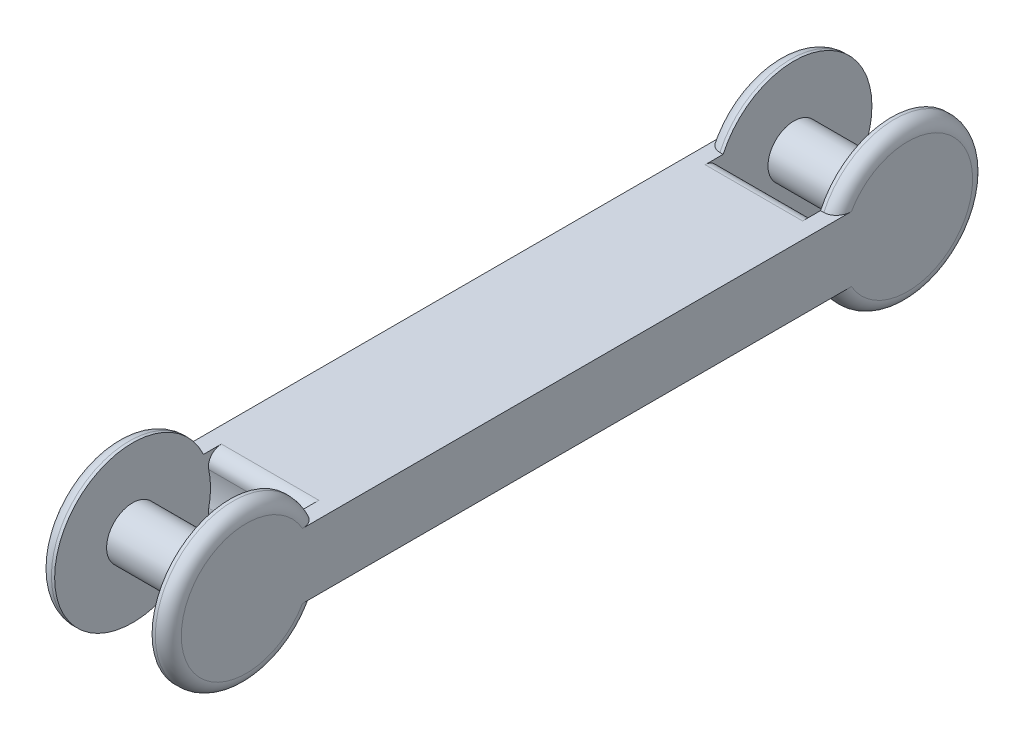
ISO-10303-21;
HEADER;
FILE_DESCRIPTION(('STEP AP214'),'2;1');
FILE_NAME('part.step','',(''),(''),'','','');
FILE_SCHEMA(('AUTOMOTIVE_DESIGN { 1 0 10303 214 1 1 1 1 }'));
ENDSEC;
DATA;
#1=APPLICATION_CONTEXT('core data for automotive mechanical design processes');
#2=APPLICATION_PROTOCOL_DEFINITION('international standard','automotive_design',2000,#1);
#3=PRODUCT_CONTEXT('',#1,'mechanical');
#4=PRODUCT('Part','Part','',(#3));
#5=PRODUCT_RELATED_PRODUCT_CATEGORY('part','',(#4));
#6=PRODUCT_DEFINITION_FORMATION('','',#4);
#7=PRODUCT_DEFINITION_CONTEXT('part definition',#1,'design');
#8=PRODUCT_DEFINITION('design','',#6,#7);
#9=PRODUCT_DEFINITION_SHAPE('','',#8);
#10=(LENGTH_UNIT() NAMED_UNIT(*) SI_UNIT(.MILLI.,.METRE.));
#11=(NAMED_UNIT(*) PLANE_ANGLE_UNIT() SI_UNIT($,.RADIAN.));
#12=(NAMED_UNIT(*) SI_UNIT($,.STERADIAN.) SOLID_ANGLE_UNIT());
#13=UNCERTAINTY_MEASURE_WITH_UNIT(LENGTH_MEASURE(1.E-05),#10,'distance_accuracy_value','');
#14=(GEOMETRIC_REPRESENTATION_CONTEXT(3) GLOBAL_UNCERTAINTY_ASSIGNED_CONTEXT((#13)) GLOBAL_UNIT_ASSIGNED_CONTEXT((#10,
#11,#12)) REPRESENTATION_CONTEXT('',''));
#15=CARTESIAN_POINT('',(0.,0.,0.));
#16=DIRECTION('',(0.,0.,1.));
#17=DIRECTION('',(1.,0.,0.));
#18=AXIS2_PLACEMENT_3D('',#15,#16,#17);
#19=CARTESIAN_POINT('',(20.,-5.00000000000001,-50.9087121146357));
#20=DIRECTION('',(-1.,0.,0.));
#21=DIRECTION('',(0.,0.,1.));
#22=AXIS2_PLACEMENT_3D('',#19,#20,#21);
#23=CYLINDRICAL_SURFACE('',#22,12.);
#24=DIRECTION('',(-1.,0.,0.));
#25=VECTOR('',#24,1.);
#26=CARTESIAN_POINT('',(20.,-10.,-40.));
#27=LINE('',#26,#25);
#28=CARTESIAN_POINT('',(2.5,-10.,-40.));
#29=VERTEX_POINT('',#28);
#30=CARTESIAN_POINT('',(2.,-10.,-40.));
#31=VERTEX_POINT('',#30);
#32=EDGE_CURVE('E191',#29,#31,#27,.T.);
#33=ORIENTED_EDGE('',*,*,#32,.T.);
#34=CARTESIAN_POINT('',(2.,-5.00000000000001,-50.9087121146357));
#35=DIRECTION('',(1.,0.,0.));
#36=DIRECTION('',(0.,0.,-1.));
#37=AXIS2_PLACEMENT_3D('',#34,#35,#36);
#38=CIRCLE('',#37,12.);
#39=CARTESIAN_POINT('',(2.,0.,-40.));
#40=VERTEX_POINT('',#39);
#41=EDGE_CURVE('E328',#31,#40,#38,.T.);
#42=ORIENTED_EDGE('',*,*,#41,.T.);
#43=DIRECTION('',(-1.,0.,0.));
#44=VECTOR('',#43,1.);
#45=CARTESIAN_POINT('',(20.,0.,-40.));
#46=LINE('',#45,#44);
#47=CARTESIAN_POINT('',(2.5,0.,-40.));
#48=VERTEX_POINT('',#47);
#49=EDGE_CURVE('E206',#48,#40,#46,.T.);
#50=ORIENTED_EDGE('',*,*,#49,.F.);
#51=CARTESIAN_POINT('',(2.5,-5.00000000000001,-50.9087121146357));
#52=DIRECTION('',(-1.,0.,0.));
#53=DIRECTION('',(0.,0.,1.));
#54=AXIS2_PLACEMENT_3D('',#51,#52,#53);
#55=CIRCLE('',#54,12.);
#56=EDGE_CURVE('E199',#48,#29,#55,.T.);
#57=ORIENTED_EDGE('',*,*,#56,.T.);
#58=EDGE_LOOP('',(#33,#42,#50,#57));
#59=FACE_BOUND('',#58,.T.);
#60=ADVANCED_FACE('F34',(#59),#23,.T.);
#61=CARTESIAN_POINT('',(20.,-5.00000000000001,50.9087121146357));
#62=DIRECTION('',(-1.,0.,0.));
#63=DIRECTION('',(0.,0.,1.));
#64=AXIS2_PLACEMENT_3D('',#61,#62,#63);
#65=CYLINDRICAL_SURFACE('',#64,12.);
#66=DIRECTION('',(-1.,0.,0.));
#67=VECTOR('',#66,1.);
#68=CARTESIAN_POINT('',(20.,0.,40.));
#69=LINE('',#68,#67);
#70=CARTESIAN_POINT('',(2.5,0.,40.));
#71=VERTEX_POINT('',#70);
#72=CARTESIAN_POINT('',(2.,0.,40.));
#73=VERTEX_POINT('',#72);
#74=EDGE_CURVE('E233',#71,#73,#69,.T.);
#75=ORIENTED_EDGE('',*,*,#74,.T.);
#76=CARTESIAN_POINT('',(2.,-5.00000000000001,50.9087121146357));
#77=DIRECTION('',(1.,0.,0.));
#78=DIRECTION('',(0.,0.,-1.));
#79=AXIS2_PLACEMENT_3D('',#76,#77,#78);
#80=CIRCLE('',#79,12.);
#81=CARTESIAN_POINT('',(2.,-10.,40.));
#82=VERTEX_POINT('',#81);
#83=EDGE_CURVE('E237',#73,#82,#80,.T.);
#84=ORIENTED_EDGE('',*,*,#83,.T.);
#85=DIRECTION('',(-1.,0.,0.));
#86=VECTOR('',#85,1.);
#87=CARTESIAN_POINT('',(20.,-10.,40.));
#88=LINE('',#87,#86);
#89=CARTESIAN_POINT('',(2.5,-10.,40.));
#90=VERTEX_POINT('',#89);
#91=EDGE_CURVE('E227',#90,#82,#88,.T.);
#92=ORIENTED_EDGE('',*,*,#91,.F.);
#93=CARTESIAN_POINT('',(2.5,-5.00000000000001,50.9087121146357));
#94=DIRECTION('',(1.,0.,0.));
#95=DIRECTION('',(0.,0.,-1.));
#96=AXIS2_PLACEMENT_3D('',#93,#94,#95);
#97=CIRCLE('',#96,12.);
#98=EDGE_CURVE('E214',#71,#90,#97,.T.);
#99=ORIENTED_EDGE('',*,*,#98,.F.);
#100=EDGE_LOOP('',(#75,#84,#92,#99));
#101=FACE_BOUND('',#100,.T.);
#102=ADVANCED_FACE('F443',(#101),#65,.T.);
#103=CARTESIAN_POINT('',(20.,0.,0.));
#104=DIRECTION('',(0.,-1.,0.));
#105=DIRECTION('',(0.,0.,-1.));
#106=AXIS2_PLACEMENT_3D('',#103,#104,#105);
#107=PLANE('',#106);
#108=DIRECTION('',(-1.,0.,0.));
#109=VECTOR('',#108,1.);
#110=CARTESIAN_POINT('',(2.5,0.,-37.2339177834584));
#111=LINE('',#110,#109);
#112=CARTESIAN_POINT('',(17.5,0.,-37.2339177834584));
#113=VERTEX_POINT('',#112);
#114=CARTESIAN_POINT('',(2.5,0.,-37.2339177834584));
#115=VERTEX_POINT('',#114);
#116=EDGE_CURVE('E341',#113,#115,#111,.T.);
#117=ORIENTED_EDGE('',*,*,#116,.T.);
#118=DIRECTION('',(0.,0.,-1.));
#119=VECTOR('',#118,1.);
#120=CARTESIAN_POINT('',(2.5,0.,-50.9087121146357));
#121=LINE('',#120,#119);
#122=EDGE_CURVE('E344',#115,#48,#121,.T.);
#123=ORIENTED_EDGE('',*,*,#122,.T.);
#124=ORIENTED_EDGE('',*,*,#49,.T.);
#125=CARTESIAN_POINT('',(2.,0.,-40.));
#126=CARTESIAN_POINT('',(1.94761864865197,0.,-39.9999920607636));
#127=CARTESIAN_POINT('',(1.89524113439899,0.,-40.002263560276));
#128=CARTESIAN_POINT('',(1.79088620311427,0.,-40.0113045157115));
#129=CARTESIAN_POINT('',(1.73890870617236,0.,-40.0180730483718));
#130=CARTESIAN_POINT('',(1.63587535487992,0.,-40.0360209027283));
#131=CARTESIAN_POINT('',(1.5848172490624,0.,-40.047187262346));
#132=CARTESIAN_POINT('',(1.48384399105233,0.,-40.0738036078068));
#133=CARTESIAN_POINT('',(1.43392885873615,0.,-40.0892536680826));
#134=CARTESIAN_POINT('',(1.28644831660157,0.,-40.1418075385946));
#135=CARTESIAN_POINT('',(1.19102421349795,0.,-40.1851368942232));
#136=CARTESIAN_POINT('',(1.00852531254498,0.,-40.2867054531951));
#137=CARTESIAN_POINT('',(0.921454306536901,0.,-40.344951384222));
#138=CARTESIAN_POINT('',(0.75486308279111,0.,-40.4764207790665));
#139=CARTESIAN_POINT('',(0.675676091014272,0.,-40.5500659671956));
#140=CARTESIAN_POINT('',(0.52963453175896,0.,-40.7086521318175));
#141=CARTESIAN_POINT('',(0.462781215257144,0.,-40.7935942526304));
#142=CARTESIAN_POINT('',(0.337143062306122,0.,-40.9799740296775));
#143=CARTESIAN_POINT('',(0.27953038496625,0.,-41.082200448377));
#144=CARTESIAN_POINT('',(0.180335553841793,0.,-41.2942407556589));
#145=CARTESIAN_POINT('',(0.138772501190277,0.,-41.404063502776));
#146=CARTESIAN_POINT('',(0.0698809101218753,0.,-41.6349866048228));
#147=CARTESIAN_POINT('',(0.0435149501782898,0.,-41.7563718328889));
#148=CARTESIAN_POINT('',(0.00857812893248845,0.,-42.0013701799645));
#149=CARTESIAN_POINT('',(-3.90550423730111E-05,0.,-42.1249766480399));
#150=CARTESIAN_POINT('',(0.,0.,-42.2484580767913));
#151=B_SPLINE_CURVE_WITH_KNOTS('',3,(#125,#126,#127,#128,#129,#130,#131,#132,#133,#134,#135,
#136,#137,#138,#139,#140,#141,#142,#143,#144,#145,#146,#147,#148,#149,#150),.UNSPECIFIED.,.F.,
.F.,(4,2,2,2,2,2,2,2,2,2,2,2,4),(0.,0.157088262959667,0.314144284895595,0.470740825804249,
0.627340087871191,0.9401669836615,1.25313522009008,1.5761765587758,1.89925064481843,
2.24984124067116,2.6008478081623,2.97216040008188,3.34250266596835),.UNSPECIFIED.);
#152=CARTESIAN_POINT('',(0.,0.,-42.2484580767913));
#153=VERTEX_POINT('',#152);
#154=EDGE_CURVE('E353',#40,#153,#151,.T.);
#155=ORIENTED_EDGE('',*,*,#154,.T.);
#156=DIRECTION('',(0.,0.,1.));
#157=VECTOR('',#156,1.);
#158=CARTESIAN_POINT('',(0.,0.,0.));
#159=LINE('',#158,#157);
#160=CARTESIAN_POINT('',(0.,0.,42.2484580767913));
#161=VERTEX_POINT('',#160);
#162=EDGE_CURVE('E217',#153,#161,#159,.T.);
#163=ORIENTED_EDGE('',*,*,#162,.T.);
#164=CARTESIAN_POINT('',(0.,0.,42.2484580767913));
#165=CARTESIAN_POINT('',(4.8833210205639E-06,0.,42.1780449974531));
#166=CARTESIAN_POINT('',(0.00279075934594604,0.,42.107657599263));
#167=CARTESIAN_POINT('',(0.0140363254196324,0.,41.9673048664754));
#168=CARTESIAN_POINT('',(0.0224987825539634,0.,41.8973397545144));
#169=CARTESIAN_POINT('',(0.0566586694762077,0.,41.6881638020816));
#170=CARTESIAN_POINT('',(0.0911305976199109,0.,41.5502606044559));
#171=CARTESIAN_POINT('',(0.183906293736824,0.,41.2821861846151));
#172=CARTESIAN_POINT('',(0.242288091272972,0.,41.1520418917903));
#173=CARTESIAN_POINT('',(0.382392919044137,0.,40.9051955188518));
#174=CARTESIAN_POINT('',(0.464062182699028,0.,40.7884633336651));
#175=CARTESIAN_POINT('',(0.639724376170037,0.,40.5845853112575));
#176=CARTESIAN_POINT('',(0.731625212290166,0.,40.4956390915064));
#177=CARTESIAN_POINT('',(0.930766416202459,0.,40.3367937467113));
#178=CARTESIAN_POINT('',(1.03800534271632,0.,40.2668928338227));
#179=CARTESIAN_POINT('',(1.25145083020004,0.,40.1564326431026));
#180=CARTESIAN_POINT('',(1.35641215028951,0.,40.1134546791329));
#181=CARTESIAN_POINT('',(1.57230306403472,0.,40.0473924478884));
#182=CARTESIAN_POINT('',(1.68321854919432,0.,40.0242631832956));
#183=CARTESIAN_POINT('',(1.82916894284576,0.,40.0077146311767));
#184=CARTESIAN_POINT('',(1.86329784951192,0.,40.004821058003));
#185=CARTESIAN_POINT('',(1.93161241425359,0.,40.0009665770984));
#186=CARTESIAN_POINT('',(1.96579790614384,0.,40.0000027255737));
#187=CARTESIAN_POINT('',(1.99999999999999,0.,40.));
#188=B_SPLINE_CURVE_WITH_KNOTS('',3,(#164,#165,#166,#167,#168,#169,#170,#171,#172,#173,#174,
#175,#176,#177,#178,#179,#180,#181,#182,#183,#184,#185,#186,#187),.UNSPECIFIED.,.F.,.F.,(4,2,2,
2,2,2,2,2,2,2,2,4),(0.,0.21112738577294,0.422357761792289,0.84656219445089,1.27216218668594,
1.69678739274252,2.07831513246147,2.45980704458993,2.79831280234283,3.13604911945941,
3.23876550054803,3.34132506785181),.UNSPECIFIED.);
#189=EDGE_CURVE('E277',#161,#73,#188,.T.);
#190=ORIENTED_EDGE('',*,*,#189,.T.);
#191=ORIENTED_EDGE('',*,*,#74,.F.);
#192=DIRECTION('',(0.,0.,-1.));
#193=VECTOR('',#192,1.);
#194=CARTESIAN_POINT('',(2.5,0.,50.9087121146357));
#195=LINE('',#194,#193);
#196=CARTESIAN_POINT('',(2.5,0.,37.2339177834584));
#197=VERTEX_POINT('',#196);
#198=EDGE_CURVE('E260',#71,#197,#195,.T.);
#199=ORIENTED_EDGE('',*,*,#198,.T.);
#200=DIRECTION('',(1.,0.,0.));
#201=VECTOR('',#200,1.);
#202=CARTESIAN_POINT('',(20.,0.,37.2339177834584));
#203=LINE('',#202,#201);
#204=CARTESIAN_POINT('',(17.5,0.,37.2339177834584));
#205=VERTEX_POINT('',#204);
#206=EDGE_CURVE('E263',#197,#205,#203,.T.);
#207=ORIENTED_EDGE('',*,*,#206,.T.);
#208=DIRECTION('',(0.,0.,1.));
#209=VECTOR('',#208,1.);
#210=CARTESIAN_POINT('',(17.5,0.,0.));
#211=LINE('',#210,#209);
#212=CARTESIAN_POINT('',(17.5,0.,40.));
#213=VERTEX_POINT('',#212);
#214=EDGE_CURVE('E266',#205,#213,#211,.T.);
#215=ORIENTED_EDGE('',*,*,#214,.T.);
#216=CARTESIAN_POINT('',(18.,0.,40.));
#217=VERTEX_POINT('',#216);
#218=EDGE_CURVE('E234',#217,#213,#69,.T.);
#219=ORIENTED_EDGE('',*,*,#218,.F.);
#220=CARTESIAN_POINT('',(18.,0.,40.));
#221=CARTESIAN_POINT('',(18.052381351348,0.,39.9999920607636));
#222=CARTESIAN_POINT('',(18.104758865601,0.,40.002263560276));
#223=CARTESIAN_POINT('',(18.2091137968857,0.,40.0113045157115));
#224=CARTESIAN_POINT('',(18.2610912938276,0.,40.0180730483718));
#225=CARTESIAN_POINT('',(18.3641246451201,0.,40.0360209027283));
#226=CARTESIAN_POINT('',(18.4151827509376,0.,40.047187262346));
#227=CARTESIAN_POINT('',(18.5161560089477,0.,40.0738036078068));
#228=CARTESIAN_POINT('',(18.5660711412638,0.,40.0892536680826));
#229=CARTESIAN_POINT('',(18.7135516833984,0.,40.1418075385946));
#230=CARTESIAN_POINT('',(18.808975786502,0.,40.1851368942232));
#231=CARTESIAN_POINT('',(18.991474687455,0.,40.2867054531951));
#232=CARTESIAN_POINT('',(19.0785456934631,0.,40.344951384222));
#233=CARTESIAN_POINT('',(19.2451369172089,0.,40.4764207790665));
#234=CARTESIAN_POINT('',(19.3243239089857,0.,40.5500659671956));
#235=CARTESIAN_POINT('',(19.470365468241,0.,40.7086521318175));
#236=CARTESIAN_POINT('',(19.5372187847429,0.,40.7935942526304));
#237=CARTESIAN_POINT('',(19.6628569376939,0.,40.9799740296775));
#238=CARTESIAN_POINT('',(19.7204696150338,0.,41.082200448377));
#239=CARTESIAN_POINT('',(19.8196644461582,0.,41.2942407556589));
#240=CARTESIAN_POINT('',(19.8612274988097,0.,41.404063502776));
#241=CARTESIAN_POINT('',(19.9301190898781,0.,41.6349866048227));
#242=CARTESIAN_POINT('',(19.9564850498217,0.,41.7563718328889));
#243=CARTESIAN_POINT('',(19.9914218710675,0.,42.0013701799645));
#244=CARTESIAN_POINT('',(20.0000390550424,0.,42.1249766480399));
#245=CARTESIAN_POINT('',(20.,0.,42.2484580767913));
#246=B_SPLINE_CURVE_WITH_KNOTS('',3,(#220,#221,#222,#223,#224,#225,#226,#227,#228,#229,#230,
#231,#232,#233,#234,#235,#236,#237,#238,#239,#240,#241,#242,#243,#244,#245),.UNSPECIFIED.,.F.,
.F.,(4,2,2,2,2,2,2,2,2,2,2,2,4),(0.,0.157088262959668,0.314144284895599,0.47074082580425,
0.627340087871192,0.940166983661496,1.25313522009008,1.5761765587758,1.89925064481843,
2.24984124067117,2.6008478081623,2.97216040008188,3.34250266596835),.UNSPECIFIED.);
#247=CARTESIAN_POINT('',(20.,0.,42.2484580767913));
#248=VERTEX_POINT('',#247);
#249=EDGE_CURVE('E310',#217,#248,#246,.T.);
#250=ORIENTED_EDGE('',*,*,#249,.T.);
#251=DIRECTION('',(0.,0.,1.));
#252=VECTOR('',#251,1.);
#253=CARTESIAN_POINT('',(20.,0.,0.));
#254=LINE('',#253,#252);
#255=CARTESIAN_POINT('',(20.,0.,-42.2484580767913));
#256=VERTEX_POINT('',#255);
#257=EDGE_CURVE('E222',#256,#248,#254,.T.);
#258=ORIENTED_EDGE('',*,*,#257,.F.);
#259=CARTESIAN_POINT('',(20.,0.,-42.2484580767913));
#260=CARTESIAN_POINT('',(19.999995116679,0.,-42.1780449974531));
#261=CARTESIAN_POINT('',(19.9972092406541,0.,-42.107657599263));
#262=CARTESIAN_POINT('',(19.9859636745804,0.,-41.9673048664754));
#263=CARTESIAN_POINT('',(19.977501217446,0.,-41.8973397545144));
#264=CARTESIAN_POINT('',(19.9433413305238,0.,-41.6881638020816));
#265=CARTESIAN_POINT('',(19.9088694023801,0.,-41.5502606044559));
#266=CARTESIAN_POINT('',(19.8160937062632,0.,-41.2821861846151));
#267=CARTESIAN_POINT('',(19.757711908727,0.,-41.1520418917903));
#268=CARTESIAN_POINT('',(19.6176070809559,0.,-40.9051955188518));
#269=CARTESIAN_POINT('',(19.535937817301,0.,-40.7884633336651));
#270=CARTESIAN_POINT('',(19.36027562383,0.,-40.5845853112575));
#271=CARTESIAN_POINT('',(19.2683747877098,0.,-40.4956390915064));
#272=CARTESIAN_POINT('',(19.0692335837975,0.,-40.3367937467113));
#273=CARTESIAN_POINT('',(18.9619946572837,0.,-40.2668928338227));
#274=CARTESIAN_POINT('',(18.7485491698,0.,-40.1564326431026));
#275=CARTESIAN_POINT('',(18.6435878497105,0.,-40.1134546791329));
#276=CARTESIAN_POINT('',(18.4276969359653,0.,-40.0473924478884));
#277=CARTESIAN_POINT('',(18.3167814508057,0.,-40.0242631832956));
#278=CARTESIAN_POINT('',(18.1708310571542,0.,-40.0077146311767));
#279=CARTESIAN_POINT('',(18.1367021504881,0.,-40.004821058003));
#280=CARTESIAN_POINT('',(18.0683875857464,0.,-40.0009665770984));
#281=CARTESIAN_POINT('',(18.0342020938562,0.,-40.0000027255737));
#282=CARTESIAN_POINT('',(18.,0.,-40.));
#283=B_SPLINE_CURVE_WITH_KNOTS('',3,(#259,#260,#261,#262,#263,#264,#265,#266,#267,#268,#269,
#270,#271,#272,#273,#274,#275,#276,#277,#278,#279,#280,#281,#282),.UNSPECIFIED.,.F.,.F.,(4,2,2,
2,2,2,2,2,2,2,2,4),(0.,0.211127385772933,0.422357761792289,0.84656219445089,1.27216218668593,
1.69678739274252,2.07831513246148,2.45980704458993,2.79831280234283,3.13604911945941,
3.23876550054804,3.34132506785182),.UNSPECIFIED.);
#284=CARTESIAN_POINT('',(18.,0.,-40.));
#285=VERTEX_POINT('',#284);
#286=EDGE_CURVE('E379',#256,#285,#283,.T.);
#287=ORIENTED_EDGE('',*,*,#286,.T.);
#288=CARTESIAN_POINT('',(17.5,0.,-40.));
#289=VERTEX_POINT('',#288);
#290=EDGE_CURVE('E205',#285,#289,#46,.T.);
#291=ORIENTED_EDGE('',*,*,#290,.T.);
#292=DIRECTION('',(0.,0.,1.));
#293=VECTOR('',#292,1.);
#294=CARTESIAN_POINT('',(17.5,0.,0.));
#295=LINE('',#294,#293);
#296=EDGE_CURVE('E48',#289,#113,#295,.T.);
#297=ORIENTED_EDGE('',*,*,#296,.T.);
#298=EDGE_LOOP('',(#117,#123,#124,#155,#163,#190,#191,#199,#207,#215,#219,#250,#258,#287,#291,#297));
#299=FACE_BOUND('',#298,.T.);
#300=ADVANCED_FACE('F294',(#299),#107,.F.);
#301=CARTESIAN_POINT('',(18.,-10.,40.));
#302=VERTEX_POINT('',#301);
#303=CARTESIAN_POINT('',(17.5,-10.,40.));
#304=VERTEX_POINT('',#303);
#305=EDGE_CURVE('E230',#302,#304,#88,.T.);
#306=ORIENTED_EDGE('',*,*,#305,.F.);
#307=CARTESIAN_POINT('',(18.,-5.00000000000001,50.9087121146357));
#308=DIRECTION('',(1.,0.,0.));
#309=DIRECTION('',(0.,0.,-1.));
#310=AXIS2_PLACEMENT_3D('',#307,#308,#309);
#311=CIRCLE('',#310,12.);
#312=EDGE_CURVE('E246',#302,#217,#311,.F.);
#313=ORIENTED_EDGE('',*,*,#312,.T.);
#314=ORIENTED_EDGE('',*,*,#218,.T.);
#315=CARTESIAN_POINT('',(17.5,-5.00000000000001,50.9087121146357));
#316=DIRECTION('',(1.,0.,0.));
#317=DIRECTION('',(0.,0.,-1.));
#318=AXIS2_PLACEMENT_3D('',#315,#316,#317);
#319=CIRCLE('',#318,12.);
#320=EDGE_CURVE('E219',#213,#304,#319,.T.);
#321=ORIENTED_EDGE('',*,*,#320,.T.);
#322=EDGE_LOOP('',(#306,#313,#314,#321));
#323=FACE_BOUND('',#322,.T.);
#324=ADVANCED_FACE('F422',(#323),#65,.T.);
#325=CARTESIAN_POINT('',(20.,-10.,40.));
#326=DIRECTION('',(0.,1.,0.));
#327=DIRECTION('',(0.,0.,1.));
#328=AXIS2_PLACEMENT_3D('',#325,#326,#327);
#329=PLANE('',#328);
#330=ORIENTED_EDGE('',*,*,#32,.F.);
#331=DIRECTION('',(0.,0.,1.));
#332=VECTOR('',#331,1.);
#333=CARTESIAN_POINT('',(2.5,-10.,-50.9087121146357));
#334=LINE('',#333,#332);
#335=CARTESIAN_POINT('',(2.5,-10.,-37.2339177834584));
#336=VERTEX_POINT('',#335);
#337=EDGE_CURVE('E56',#29,#336,#334,.T.);
#338=ORIENTED_EDGE('',*,*,#337,.T.);
#339=DIRECTION('',(-1.,0.,0.));
#340=VECTOR('',#339,1.);
#341=CARTESIAN_POINT('',(17.5,-10.,-37.2339177834584));
#342=LINE('',#341,#340);
#343=CARTESIAN_POINT('',(17.5,-10.,-37.2339177834584));
#344=VERTEX_POINT('',#343);
#345=EDGE_CURVE('E178',#336,#344,#342,.F.);
#346=ORIENTED_EDGE('',*,*,#345,.T.);
#347=DIRECTION('',(0.,0.,-1.));
#348=VECTOR('',#347,1.);
#349=CARTESIAN_POINT('',(17.5,-10.,40.));
#350=LINE('',#349,#348);
#351=CARTESIAN_POINT('',(17.5,-10.,-40.));
#352=VERTEX_POINT('',#351);
#353=EDGE_CURVE('E172',#344,#352,#350,.T.);
#354=ORIENTED_EDGE('',*,*,#353,.T.);
#355=CARTESIAN_POINT('',(18.,-10.,-40.));
#356=VERTEX_POINT('',#355);
#357=EDGE_CURVE('E176',#356,#352,#27,.T.);
#358=ORIENTED_EDGE('',*,*,#357,.F.);
#359=CARTESIAN_POINT('',(18.,-10.,-40.));
#360=CARTESIAN_POINT('',(18.052381351348,-10.,-39.9999920607636));
#361=CARTESIAN_POINT('',(18.104758865601,-10.,-40.002263560276));
#362=CARTESIAN_POINT('',(18.2091137968857,-10.,-40.0113045157115));
#363=CARTESIAN_POINT('',(18.2610912938276,-10.,-40.0180730483718));
#364=CARTESIAN_POINT('',(18.3641246451201,-10.,-40.0360209027283));
#365=CARTESIAN_POINT('',(18.4151827509376,-10.,-40.047187262346));
#366=CARTESIAN_POINT('',(18.5161560089477,-10.,-40.0738036078068));
#367=CARTESIAN_POINT('',(18.5660711412638,-10.,-40.0892536680826));
#368=CARTESIAN_POINT('',(18.7135516833984,-10.,-40.1418075385946));
#369=CARTESIAN_POINT('',(18.808975786502,-10.,-40.1851368942232));
#370=CARTESIAN_POINT('',(18.991474687455,-10.,-40.2867054531951));
#371=CARTESIAN_POINT('',(19.0785456934631,-10.,-40.344951384222));
#372=CARTESIAN_POINT('',(19.2451369172089,-10.,-40.4764207790665));
#373=CARTESIAN_POINT('',(19.3243239089857,-10.,-40.5500659671956));
#374=CARTESIAN_POINT('',(19.470365468241,-10.,-40.7086521318175));
#375=CARTESIAN_POINT('',(19.5372187847429,-10.,-40.7935942526304));
#376=CARTESIAN_POINT('',(19.6628569376939,-10.,-40.9799740296775));
#377=CARTESIAN_POINT('',(19.7204696150337,-10.,-41.0822004483769));
#378=CARTESIAN_POINT('',(19.8196644461582,-10.,-41.2942407556589));
#379=CARTESIAN_POINT('',(19.8612274988097,-10.,-41.404063502776));
#380=CARTESIAN_POINT('',(19.9301190898781,-10.,-41.6349866048227));
#381=CARTESIAN_POINT('',(19.9564850498217,-10.,-41.7563718328889));
#382=CARTESIAN_POINT('',(19.9914218710675,-10.,-42.0013701799645));
#383=CARTESIAN_POINT('',(20.0000390550424,-10.,-42.1249766480399));
#384=CARTESIAN_POINT('',(20.,-10.,-42.2484580767913));
#385=B_SPLINE_CURVE_WITH_KNOTS('',3,(#359,#360,#361,#362,#363,#364,#365,#366,#367,#368,#369,
#370,#371,#372,#373,#374,#375,#376,#377,#378,#379,#380,#381,#382,#383,#384),.UNSPECIFIED.,.F.,
.F.,(4,2,2,2,2,2,2,2,2,2,2,2,4),(0.,0.157088262959665,0.314144284895595,0.470740825804251,
0.627340087871189,0.940166983661496,1.25313522009008,1.57617655877579,1.89925064481842,
2.24984124067116,2.6008478081623,2.97216040008188,3.34250266596836),.UNSPECIFIED.);
#386=CARTESIAN_POINT('',(20.,-10.,-42.2484580767913));
#387=VERTEX_POINT('',#386);
#388=EDGE_CURVE('E373',#356,#387,#385,.T.);
#389=ORIENTED_EDGE('',*,*,#388,.T.);
#390=DIRECTION('',(0.,0.,-1.));
#391=VECTOR('',#390,1.);
#392=CARTESIAN_POINT('',(20.,-10.,40.));
#393=LINE('',#392,#391);
#394=CARTESIAN_POINT('',(20.,-10.,42.2484580767913));
#395=VERTEX_POINT('',#394);
#396=EDGE_CURVE('E224',#395,#387,#393,.T.);
#397=ORIENTED_EDGE('',*,*,#396,.F.);
#398=CARTESIAN_POINT('',(20.,-10.,42.2484580767913));
#399=CARTESIAN_POINT('',(19.999995116679,-10.,42.1780449974531));
#400=CARTESIAN_POINT('',(19.9972092406541,-10.,42.107657599263));
#401=CARTESIAN_POINT('',(19.9859636745804,-10.,41.9673048664754));
#402=CARTESIAN_POINT('',(19.977501217446,-10.,41.8973397545144));
#403=CARTESIAN_POINT('',(19.9433413305238,-10.,41.6881638020816));
#404=CARTESIAN_POINT('',(19.9088694023801,-10.,41.5502606044559));
#405=CARTESIAN_POINT('',(19.8160937062632,-10.,41.2821861846151));
#406=CARTESIAN_POINT('',(19.757711908727,-10.,41.1520418917903));
#407=CARTESIAN_POINT('',(19.6176070809559,-10.,40.9051955188518));
#408=CARTESIAN_POINT('',(19.535937817301,-10.,40.7884633336651));
#409=CARTESIAN_POINT('',(19.36027562383,-10.,40.5845853112575));
#410=CARTESIAN_POINT('',(19.2683747877098,-10.,40.4956390915064));
#411=CARTESIAN_POINT('',(19.0692335837975,-10.,40.3367937467113));
#412=CARTESIAN_POINT('',(18.9619946572837,-10.,40.2668928338227));
#413=CARTESIAN_POINT('',(18.7485491698,-10.,40.1564326431026));
#414=CARTESIAN_POINT('',(18.6435878497105,-10.,40.1134546791329));
#415=CARTESIAN_POINT('',(18.4276969359653,-10.,40.0473924478884));
#416=CARTESIAN_POINT('',(18.3167814508057,-10.,40.0242631832956));
#417=CARTESIAN_POINT('',(18.1708310571542,-10.,40.0077146311767));
#418=CARTESIAN_POINT('',(18.1367021504881,-10.,40.004821058003));
#419=CARTESIAN_POINT('',(18.0683875857464,-10.,40.0009665770984));
#420=CARTESIAN_POINT('',(18.0342020938562,-10.,40.0000027255737));
#421=CARTESIAN_POINT('',(18.,-10.,40.));
#422=B_SPLINE_CURVE_WITH_KNOTS('',3,(#398,#399,#400,#401,#402,#403,#404,#405,#406,#407,#408,
#409,#410,#411,#412,#413,#414,#415,#416,#417,#418,#419,#420,#421),.UNSPECIFIED.,.F.,.F.,(4,2,2,
2,2,2,2,2,2,2,2,4),(0.,0.211127385772926,0.422357761792289,0.84656219445089,1.27216218668593,
1.69678739274252,2.07831513246148,2.45980704458993,2.79831280234283,3.13604911945941,
3.23876550054804,3.34132506785182),.UNSPECIFIED.);
#423=EDGE_CURVE('E304',#395,#302,#422,.T.);
#424=ORIENTED_EDGE('',*,*,#423,.T.);
#425=ORIENTED_EDGE('',*,*,#305,.T.);
#426=DIRECTION('',(0.,0.,-1.));
#427=VECTOR('',#426,1.);
#428=CARTESIAN_POINT('',(17.5,-10.,40.));
#429=LINE('',#428,#427);
#430=CARTESIAN_POINT('',(17.5,-10.,37.2339177834584));
#431=VERTEX_POINT('',#430);
#432=EDGE_CURVE('E248',#304,#431,#429,.T.);
#433=ORIENTED_EDGE('',*,*,#432,.T.);
#434=DIRECTION('',(1.,0.,0.));
#435=VECTOR('',#434,1.);
#436=CARTESIAN_POINT('',(20.,-10.,37.2339177834584));
#437=LINE('',#436,#435);
#438=CARTESIAN_POINT('',(2.5,-10.,37.2339177834584));
#439=VERTEX_POINT('',#438);
#440=EDGE_CURVE('E251',#431,#439,#437,.F.);
#441=ORIENTED_EDGE('',*,*,#440,.T.);
#442=DIRECTION('',(0.,0.,1.));
#443=VECTOR('',#442,1.);
#444=CARTESIAN_POINT('',(2.5,-10.,50.9087121146357));
#445=LINE('',#444,#443);
#446=EDGE_CURVE('E254',#439,#90,#445,.T.);
#447=ORIENTED_EDGE('',*,*,#446,.T.);
#448=ORIENTED_EDGE('',*,*,#91,.T.);
#449=CARTESIAN_POINT('',(2.,-10.,40.));
#450=CARTESIAN_POINT('',(1.94761864865197,-10.,39.9999920607636));
#451=CARTESIAN_POINT('',(1.89524113439899,-10.,40.002263560276));
#452=CARTESIAN_POINT('',(1.79088620311427,-10.,40.0113045157115));
#453=CARTESIAN_POINT('',(1.73890870617236,-10.,40.0180730483718));
#454=CARTESIAN_POINT('',(1.63587535487992,-10.,40.0360209027283));
#455=CARTESIAN_POINT('',(1.5848172490624,-10.,40.047187262346));
#456=CARTESIAN_POINT('',(1.48384399105233,-10.,40.0738036078068));
#457=CARTESIAN_POINT('',(1.43392885873615,-10.,40.0892536680826));
#458=CARTESIAN_POINT('',(1.28644831660157,-10.,40.1418075385946));
#459=CARTESIAN_POINT('',(1.19102421349795,-10.,40.1851368942232));
#460=CARTESIAN_POINT('',(1.00852531254499,-10.,40.2867054531951));
#461=CARTESIAN_POINT('',(0.921454306536902,-10.,40.344951384222));
#462=CARTESIAN_POINT('',(0.754863082791112,-10.,40.4764207790665));
#463=CARTESIAN_POINT('',(0.675676091014277,-10.,40.5500659671956));
#464=CARTESIAN_POINT('',(0.529634531758966,-10.,40.7086521318175));
#465=CARTESIAN_POINT('',(0.462781215257148,-10.,40.7935942526304));
#466=CARTESIAN_POINT('',(0.337143062306125,-10.,40.9799740296775));
#467=CARTESIAN_POINT('',(0.279530384966253,-10.,41.0822004483769));
#468=CARTESIAN_POINT('',(0.180335553841795,-10.,41.2942407556589));
#469=CARTESIAN_POINT('',(0.138772501190279,-10.,41.404063502776));
#470=CARTESIAN_POINT('',(0.0698809101218755,-10.,41.6349866048227));
#471=CARTESIAN_POINT('',(0.0435149501782898,-10.,41.7563718328889));
#472=CARTESIAN_POINT('',(0.00857812893248836,-10.,42.0013701799645));
#473=CARTESIAN_POINT('',(-3.90550423731312E-05,-10.,42.1249766480399));
#474=CARTESIAN_POINT('',(0.,-10.,42.2484580767913));
#475=B_SPLINE_CURVE_WITH_KNOTS('',3,(#449,#450,#451,#452,#453,#454,#455,#456,#457,#458,#459,
#460,#461,#462,#463,#464,#465,#466,#467,#468,#469,#470,#471,#472,#473,#474),.UNSPECIFIED.,.F.,
.F.,(4,2,2,2,2,2,2,2,2,2,2,2,4),(0.,0.157088262959667,0.314144284895595,0.470740825804248,
0.627340087871189,0.940166983661497,1.25313522009008,1.5761765587758,1.89925064481842,
2.24984124067116,2.6008478081623,2.97216040008188,3.34250266596835),.UNSPECIFIED.);
#476=CARTESIAN_POINT('',(0.,-10.,42.2484580767913));
#477=VERTEX_POINT('',#476);
#478=EDGE_CURVE('E268',#82,#477,#475,.T.);
#479=ORIENTED_EDGE('',*,*,#478,.T.);
#480=DIRECTION('',(0.,0.,-1.));
#481=VECTOR('',#480,1.);
#482=CARTESIAN_POINT('',(0.,-10.,40.));
#483=LINE('',#482,#481);
#484=CARTESIAN_POINT('',(0.,-10.,-42.2484580767913));
#485=VERTEX_POINT('',#484);
#486=EDGE_CURVE('E225',#477,#485,#483,.T.);
#487=ORIENTED_EDGE('',*,*,#486,.T.);
#488=CARTESIAN_POINT('',(0.,-10.,-42.2484580767913));
#489=CARTESIAN_POINT('',(4.88332102047389E-06,-10.,-42.1780449974531));
#490=CARTESIAN_POINT('',(0.00279075934594563,-10.,-42.107657599263));
#491=CARTESIAN_POINT('',(0.0140363254196313,-10.,-41.9673048664754));
#492=CARTESIAN_POINT('',(0.0224987825539622,-10.,-41.8973397545144));
#493=CARTESIAN_POINT('',(0.0566586694762065,-10.,-41.6881638020816));
#494=CARTESIAN_POINT('',(0.09113059761991,-10.,-41.5502606044559));
#495=CARTESIAN_POINT('',(0.183906293736822,-10.,-41.2821861846151));
#496=CARTESIAN_POINT('',(0.242288091272969,-10.,-41.1520418917903));
#497=CARTESIAN_POINT('',(0.382392919044135,-10.,-40.9051955188518));
#498=CARTESIAN_POINT('',(0.464062182699031,-10.,-40.7884633336651));
#499=CARTESIAN_POINT('',(0.639724376170044,-10.,-40.5845853112575));
#500=CARTESIAN_POINT('',(0.73162521229017,-10.,-40.4956390915064));
#501=CARTESIAN_POINT('',(0.930766416202461,-10.,-40.3367937467113));
#502=CARTESIAN_POINT('',(1.03800534271633,-10.,-40.2668928338227));
#503=CARTESIAN_POINT('',(1.25145083020005,-10.,-40.1564326431026));
#504=CARTESIAN_POINT('',(1.35641215028951,-10.,-40.1134546791329));
#505=CARTESIAN_POINT('',(1.57230306403472,-10.,-40.0473924478884));
#506=CARTESIAN_POINT('',(1.68321854919432,-10.,-40.0242631832956));
#507=CARTESIAN_POINT('',(1.82916894284577,-10.,-40.0077146311767));
#508=CARTESIAN_POINT('',(1.86329784951192,-10.,-40.004821058003));
#509=CARTESIAN_POINT('',(1.9316124142536,-10.,-40.0009665770984));
#510=CARTESIAN_POINT('',(1.96579790614384,-10.,-40.0000027255737));
#511=CARTESIAN_POINT('',(2.,-10.,-40.));
#512=B_SPLINE_CURVE_WITH_KNOTS('',3,(#488,#489,#490,#491,#492,#493,#494,#495,#496,#497,#498,
#499,#500,#501,#502,#503,#504,#505,#506,#507,#508,#509,#510,#511),.UNSPECIFIED.,.F.,.F.,(4,2,2,
2,2,2,2,2,2,2,2,4),(0.,0.211127385772933,0.422357761792289,0.846562194450897,1.27216218668594,
1.69678739274254,2.07831513246149,2.45980704458994,2.79831280234284,3.13604911945942,
3.23876550054804,3.34132506785182),.UNSPECIFIED.);
#513=EDGE_CURVE('E346',#485,#31,#512,.T.);
#514=ORIENTED_EDGE('',*,*,#513,.T.);
#515=EDGE_LOOP('',(#330,#338,#346,#354,#358,#389,#397,#424,#425,#433,#441,#447,#448,#479,#487,#514));
#516=FACE_BOUND('',#515,.T.);
#517=ADVANCED_FACE('F174',(#516),#329,.F.);
#518=CARTESIAN_POINT('',(20.,-5.00000000000001,50.9087121146357));
#519=DIRECTION('',(1.,0.,0.));
#520=DIRECTION('',(0.,0.,-1.));
#521=AXIS2_PLACEMENT_3D('',#518,#519,#520);
#522=PLANE('',#521);
#523=ORIENTED_EDGE('',*,*,#396,.T.);
#524=CARTESIAN_POINT('',(20.,-5.00000000000001,-50.9087121146357));
#525=DIRECTION('',(1.,0.,0.));
#526=DIRECTION('',(0.,0.,-1.));
#527=AXIS2_PLACEMENT_3D('',#524,#525,#526);
#528=CIRCLE('',#527,10.);
#529=EDGE_CURVE('E331',#387,#256,#528,.T.);
#530=ORIENTED_EDGE('',*,*,#529,.T.);
#531=ORIENTED_EDGE('',*,*,#257,.T.);
#532=CARTESIAN_POINT('',(20.,-5.00000000000001,50.9087121146357));
#533=DIRECTION('',(1.,0.,0.));
#534=DIRECTION('',(0.,0.,-1.));
#535=AXIS2_PLACEMENT_3D('',#532,#533,#534);
#536=CIRCLE('',#535,10.);
#537=EDGE_CURVE('E243',#248,#395,#536,.T.);
#538=ORIENTED_EDGE('',*,*,#537,.T.);
#539=EDGE_LOOP('',(#523,#530,#531,#538));
#540=FACE_BOUND('',#539,.T.);
#541=ADVANCED_FACE('F459',(#540),#522,.T.);
#542=CARTESIAN_POINT('',(0.,-5.00000000000001,50.9087121146357));
#543=DIRECTION('',(1.,0.,0.));
#544=DIRECTION('',(0.,0.,-1.));
#545=AXIS2_PLACEMENT_3D('',#542,#543,#544);
#546=PLANE('',#545);
#547=CARTESIAN_POINT('',(0.,-5.00000000000001,-50.9087121146357));
#548=DIRECTION('',(1.,0.,0.));
#549=DIRECTION('',(0.,0.,-1.));
#550=AXIS2_PLACEMENT_3D('',#547,#548,#549);
#551=CIRCLE('',#550,10.);
#552=EDGE_CURVE('E325',#153,#485,#551,.F.);
#553=ORIENTED_EDGE('',*,*,#552,.T.);
#554=ORIENTED_EDGE('',*,*,#486,.F.);
#555=CARTESIAN_POINT('',(0.,-5.00000000000001,50.9087121146357));
#556=DIRECTION('',(1.,0.,0.));
#557=DIRECTION('',(0.,0.,-1.));
#558=AXIS2_PLACEMENT_3D('',#555,#556,#557);
#559=CIRCLE('',#558,10.);
#560=EDGE_CURVE('E240',#477,#161,#559,.F.);
#561=ORIENTED_EDGE('',*,*,#560,.T.);
#562=ORIENTED_EDGE('',*,*,#162,.F.);
#563=EDGE_LOOP('',(#553,#554,#561,#562));
#564=FACE_BOUND('',#563,.T.);
#565=ADVANCED_FACE('F411',(#564),#546,.F.);
#566=CARTESIAN_POINT('',(2.5,-5.00000000000001,50.9087121146357));
#567=DIRECTION('',(1.,0.,0.));
#568=DIRECTION('',(0.,0.,-1.));
#569=AXIS2_PLACEMENT_3D('',#566,#567,#568);
#570=CYLINDRICAL_SURFACE('',#569,12.);
#571=CARTESIAN_POINT('',(2.5,-7.57142857142858,39.1874598307694));
#572=VERTEX_POINT('',#571);
#573=CARTESIAN_POINT('',(2.5,-2.42857142857143,39.1874598307694));
#574=VERTEX_POINT('',#573);
#575=EDGE_CURVE('E218',#572,#574,#97,.T.);
#576=ORIENTED_EDGE('',*,*,#575,.F.);
#577=DIRECTION('',(1.,0.,0.));
#578=VECTOR('',#577,1.);
#579=CARTESIAN_POINT('',(2.5,-7.57142857142858,39.1874598307694));
#580=LINE('',#579,#578);
#581=CARTESIAN_POINT('',(17.5,-7.57142857142858,39.1874598307694));
#582=VERTEX_POINT('',#581);
#583=EDGE_CURVE('E258',#572,#582,#580,.T.);
#584=ORIENTED_EDGE('',*,*,#583,.T.);
#585=CARTESIAN_POINT('',(17.5,-2.42857142857143,39.1874598307694));
#586=VERTEX_POINT('',#585);
#587=EDGE_CURVE('E211',#582,#586,#319,.T.);
#588=ORIENTED_EDGE('',*,*,#587,.T.);
#589=DIRECTION('',(1.,0.,0.));
#590=VECTOR('',#589,1.);
#591=CARTESIAN_POINT('',(2.5,-2.42857142857143,39.1874598307694));
#592=LINE('',#591,#590);
#593=EDGE_CURVE('E256',#586,#574,#592,.F.);
#594=ORIENTED_EDGE('',*,*,#593,.T.);
#595=EDGE_LOOP('',(#576,#584,#588,#594));
#596=FACE_BOUND('',#595,.T.);
#597=ADVANCED_FACE('F450',(#596),#570,.F.);
#598=CARTESIAN_POINT('',(2.5,-5.00000000000001,50.9087121146357));
#599=DIRECTION('',(1.,0.,0.));
#600=DIRECTION('',(0.,0.,-1.));
#601=AXIS2_PLACEMENT_3D('',#598,#599,#600);
#602=PLANE('',#601);
#603=CARTESIAN_POINT('',(2.5,-5.00000000000001,50.9087121146357));
#604=DIRECTION('',(1.,0.,0.));
#605=DIRECTION('',(0.,0.,-1.));
#606=AXIS2_PLACEMENT_3D('',#603,#604,#605);
#607=CIRCLE('',#606,4.00000000000001);
#608=CARTESIAN_POINT('',(2.5,-5.00000000000001,46.9087121146357));
#609=VERTEX_POINT('',#608);
#610=EDGE_CURVE('E208',#609,#609,#607,.T.);
#611=ORIENTED_EDGE('',*,*,#610,.F.);
#612=EDGE_LOOP('',(#611));
#613=FACE_BOUND('',#612,.T.);
#614=ORIENTED_EDGE('',*,*,#98,.T.);
#615=ORIENTED_EDGE('',*,*,#446,.F.);
#616=CARTESIAN_POINT('',(2.5,-8.00000000000001,37.2339177834584));
#617=DIRECTION('',(1.,0.,0.));
#618=DIRECTION('',(0.,0.,-1.));
#619=AXIS2_PLACEMENT_3D('',#616,#617,#618);
#620=CIRCLE('',#619,2.);
#621=EDGE_CURVE('E317',#439,#572,#620,.F.);
#622=ORIENTED_EDGE('',*,*,#621,.T.);
#623=ORIENTED_EDGE('',*,*,#575,.T.);
#624=CARTESIAN_POINT('',(2.5,-2.,37.2339177834584));
#625=DIRECTION('',(1.,0.,0.));
#626=DIRECTION('',(0.,0.,-1.));
#627=AXIS2_PLACEMENT_3D('',#624,#625,#626);
#628=CIRCLE('',#627,2.);
#629=EDGE_CURVE('E323',#574,#197,#628,.F.);
#630=ORIENTED_EDGE('',*,*,#629,.T.);
#631=ORIENTED_EDGE('',*,*,#198,.F.);
#632=EDGE_LOOP('',(#614,#615,#622,#623,#630,#631));
#633=FACE_BOUND('',#632,.T.);
#634=ADVANCED_FACE('F438',(#613,#633),#602,.T.);
#635=CARTESIAN_POINT('',(17.5,-5.00000000000001,50.9087121146357));
#636=DIRECTION('',(1.,0.,0.));
#637=DIRECTION('',(0.,0.,-1.));
#638=AXIS2_PLACEMENT_3D('',#635,#636,#637);
#639=PLANE('',#638);
#640=CARTESIAN_POINT('',(17.5,-5.00000000000001,50.9087121146357));
#641=DIRECTION('',(1.,0.,0.));
#642=DIRECTION('',(0.,0.,-1.));
#643=AXIS2_PLACEMENT_3D('',#640,#641,#642);
#644=CIRCLE('',#643,4.00000000000001);
#645=CARTESIAN_POINT('',(17.5,-5.00000000000001,46.9087121146357));
#646=VERTEX_POINT('',#645);
#647=EDGE_CURVE('E190',#646,#646,#644,.T.);
#648=ORIENTED_EDGE('',*,*,#647,.T.);
#649=EDGE_LOOP('',(#648));
#650=FACE_BOUND('',#649,.T.);
#651=ORIENTED_EDGE('',*,*,#320,.F.);
#652=ORIENTED_EDGE('',*,*,#214,.F.);
#653=CARTESIAN_POINT('',(17.5,-2.,37.2339177834584));
#654=DIRECTION('',(1.,0.,0.));
#655=DIRECTION('',(0.,0.,-1.));
#656=AXIS2_PLACEMENT_3D('',#653,#654,#655);
#657=CIRCLE('',#656,2.);
#658=EDGE_CURVE('E321',#205,#586,#657,.T.);
#659=ORIENTED_EDGE('',*,*,#658,.T.);
#660=ORIENTED_EDGE('',*,*,#587,.F.);
#661=CARTESIAN_POINT('',(17.5,-8.00000000000001,37.2339177834584));
#662=DIRECTION('',(1.,0.,0.));
#663=DIRECTION('',(0.,0.,-1.));
#664=AXIS2_PLACEMENT_3D('',#661,#662,#663);
#665=CIRCLE('',#664,2.);
#666=EDGE_CURVE('E319',#582,#431,#665,.T.);
#667=ORIENTED_EDGE('',*,*,#666,.T.);
#668=ORIENTED_EDGE('',*,*,#432,.F.);
#669=EDGE_LOOP('',(#651,#652,#659,#660,#667,#668));
#670=FACE_BOUND('',#669,.T.);
#671=ADVANCED_FACE('F428',(#650,#670),#639,.F.);
#672=CARTESIAN_POINT('',(2.5,-5.00000000000001,50.9087121146357));
#673=DIRECTION('',(1.,0.,0.));
#674=DIRECTION('',(0.,0.,-1.));
#675=AXIS2_PLACEMENT_3D('',#672,#673,#674);
#676=CYLINDRICAL_SURFACE('',#675,4.00000000000001);
#677=ORIENTED_EDGE('',*,*,#610,.T.);
#678=EDGE_LOOP('',(#677));
#679=FACE_BOUND('',#678,.T.);
#680=ORIENTED_EDGE('',*,*,#647,.F.);
#681=EDGE_LOOP('',(#680));
#682=FACE_BOUND('',#681,.T.);
#683=ADVANCED_FACE('F292',(#679,#682),#676,.T.);
#684=CARTESIAN_POINT('',(2.,-5.00000000000001,50.9087121146357));
#685=DIRECTION('',(1.,0.,0.));
#686=DIRECTION('',(0.,0.,-1.));
#687=AXIS2_PLACEMENT_3D('',#684,#685,#686);
#688=TOROIDAL_SURFACE('',#687,10.,2.);
#689=ORIENTED_EDGE('',*,*,#189,.F.);
#690=ORIENTED_EDGE('',*,*,#560,.F.);
#691=ORIENTED_EDGE('',*,*,#478,.F.);
#692=ORIENTED_EDGE('',*,*,#83,.F.);
#693=EDGE_LOOP('',(#689,#690,#691,#692));
#694=FACE_BOUND('',#693,.T.);
#695=ADVANCED_FACE('F287',(#694),#688,.T.);
#696=CARTESIAN_POINT('',(18.,-5.00000000000001,50.9087121146357));
#697=DIRECTION('',(1.,0.,0.));
#698=DIRECTION('',(0.,0.,-1.));
#699=AXIS2_PLACEMENT_3D('',#696,#697,#698);
#700=TOROIDAL_SURFACE('',#699,10.,2.);
#701=ORIENTED_EDGE('',*,*,#249,.F.);
#702=ORIENTED_EDGE('',*,*,#312,.F.);
#703=ORIENTED_EDGE('',*,*,#423,.F.);
#704=ORIENTED_EDGE('',*,*,#537,.F.);
#705=EDGE_LOOP('',(#701,#702,#703,#704));
#706=FACE_BOUND('',#705,.T.);
#707=ADVANCED_FACE('F291',(#706),#700,.T.);
#708=CARTESIAN_POINT('',(2.5,-8.00000000000001,37.2339177834584));
#709=DIRECTION('',(1.,0.,0.));
#710=DIRECTION('',(0.,0.,-1.));
#711=AXIS2_PLACEMENT_3D('',#708,#709,#710);
#712=CYLINDRICAL_SURFACE('',#711,2.);
#713=ORIENTED_EDGE('',*,*,#666,.F.);
#714=ORIENTED_EDGE('',*,*,#583,.F.);
#715=ORIENTED_EDGE('',*,*,#621,.F.);
#716=ORIENTED_EDGE('',*,*,#440,.F.);
#717=EDGE_LOOP('',(#713,#714,#715,#716));
#718=FACE_BOUND('',#717,.T.);
#719=ADVANCED_FACE('F300',(#718),#712,.T.);
#720=CARTESIAN_POINT('',(2.5,-2.,37.2339177834584));
#721=DIRECTION('',(1.,0.,0.));
#722=DIRECTION('',(0.,0.,-1.));
#723=AXIS2_PLACEMENT_3D('',#720,#721,#722);
#724=CYLINDRICAL_SURFACE('',#723,2.);
#725=ORIENTED_EDGE('',*,*,#629,.F.);
#726=ORIENTED_EDGE('',*,*,#593,.F.);
#727=ORIENTED_EDGE('',*,*,#658,.F.);
#728=ORIENTED_EDGE('',*,*,#206,.F.);
#729=EDGE_LOOP('',(#725,#726,#727,#728));
#730=FACE_BOUND('',#729,.T.);
#731=ADVANCED_FACE('F366',(#730),#724,.T.);
#732=ORIENTED_EDGE('',*,*,#290,.F.);
#733=CARTESIAN_POINT('',(18.,-5.00000000000001,-50.9087121146357));
#734=DIRECTION('',(1.,0.,0.));
#735=DIRECTION('',(0.,0.,-1.));
#736=AXIS2_PLACEMENT_3D('',#733,#734,#735);
#737=CIRCLE('',#736,12.);
#738=EDGE_CURVE('E189',#285,#356,#737,.F.);
#739=ORIENTED_EDGE('',*,*,#738,.T.);
#740=ORIENTED_EDGE('',*,*,#357,.T.);
#741=CARTESIAN_POINT('',(17.5,-5.00000000000001,-50.9087121146357));
#742=DIRECTION('',(-1.,0.,0.));
#743=DIRECTION('',(0.,0.,1.));
#744=AXIS2_PLACEMENT_3D('',#741,#742,#743);
#745=CIRCLE('',#744,12.);
#746=EDGE_CURVE('E187',#289,#352,#745,.T.);
#747=ORIENTED_EDGE('',*,*,#746,.F.);
#748=EDGE_LOOP('',(#732,#739,#740,#747));
#749=FACE_BOUND('',#748,.T.);
#750=ADVANCED_FACE('F186',(#749),#23,.T.);
#751=CARTESIAN_POINT('',(2.5,-5.00000000000001,-50.9087121146357));
#752=DIRECTION('',(1.,0.,0.));
#753=DIRECTION('',(0.,0.,-1.));
#754=AXIS2_PLACEMENT_3D('',#751,#752,#753);
#755=CYLINDRICAL_SURFACE('',#754,12.);
#756=CARTESIAN_POINT('',(17.5,-7.57142857142858,-39.1874598307694));
#757=VERTEX_POINT('',#756);
#758=CARTESIAN_POINT('',(17.5,-2.42857142857143,-39.1874598307694));
#759=VERTEX_POINT('',#758);
#760=EDGE_CURVE('E196',#757,#759,#745,.T.);
#761=ORIENTED_EDGE('',*,*,#760,.F.);
#762=DIRECTION('',(1.,0.,0.));
#763=VECTOR('',#762,1.);
#764=CARTESIAN_POINT('',(2.5,-7.57142857142858,-39.1874598307694));
#765=LINE('',#764,#763);
#766=CARTESIAN_POINT('',(2.5,-7.57142857142858,-39.1874598307694));
#767=VERTEX_POINT('',#766);
#768=EDGE_CURVE('E180',#757,#767,#765,.F.);
#769=ORIENTED_EDGE('',*,*,#768,.T.);
#770=CARTESIAN_POINT('',(2.5,-2.42857142857143,-39.1874598307694));
#771=VERTEX_POINT('',#770);
#772=EDGE_CURVE('E195',#767,#771,#55,.T.);
#773=ORIENTED_EDGE('',*,*,#772,.T.);
#774=DIRECTION('',(1.,0.,0.));
#775=VECTOR('',#774,1.);
#776=CARTESIAN_POINT('',(2.5,-2.42857142857143,-39.1874598307694));
#777=LINE('',#776,#775);
#778=EDGE_CURVE('E334',#771,#759,#777,.T.);
#779=ORIENTED_EDGE('',*,*,#778,.T.);
#780=EDGE_LOOP('',(#761,#769,#773,#779));
#781=FACE_BOUND('',#780,.T.);
#782=ADVANCED_FACE('F397',(#781),#755,.F.);
#783=CARTESIAN_POINT('',(2.5,-5.00000000000001,-50.9087121146357));
#784=DIRECTION('',(1.,0.,0.));
#785=DIRECTION('',(0.,0.,1.));
#786=AXIS2_PLACEMENT_3D('',#783,#784,#785);
#787=PLANE('',#786);
#788=ORIENTED_EDGE('',*,*,#56,.F.);
#789=ORIENTED_EDGE('',*,*,#122,.F.);
#790=CARTESIAN_POINT('',(2.5,-2.,-37.2339177834584));
#791=DIRECTION('',(1.,0.,0.));
#792=DIRECTION('',(0.,0.,-1.));
#793=AXIS2_PLACEMENT_3D('',#790,#791,#792);
#794=CIRCLE('',#793,2.);
#795=EDGE_CURVE('E42',#115,#771,#794,.F.);
#796=ORIENTED_EDGE('',*,*,#795,.T.);
#797=ORIENTED_EDGE('',*,*,#772,.F.);
#798=CARTESIAN_POINT('',(2.5,-8.00000000000001,-37.2339177834584));
#799=DIRECTION('',(1.,0.,0.));
#800=DIRECTION('',(0.,0.,-1.));
#801=AXIS2_PLACEMENT_3D('',#798,#799,#800);
#802=CIRCLE('',#801,2.);
#803=EDGE_CURVE('E385',#767,#336,#802,.F.);
#804=ORIENTED_EDGE('',*,*,#803,.T.);
#805=ORIENTED_EDGE('',*,*,#337,.F.);
#806=EDGE_LOOP('',(#788,#789,#796,#797,#804,#805));
#807=FACE_BOUND('',#806,.T.);
#808=CARTESIAN_POINT('',(2.5,-5.00000000000001,-50.9087121146357));
#809=DIRECTION('',(-1.,0.,0.));
#810=DIRECTION('',(0.,0.,1.));
#811=AXIS2_PLACEMENT_3D('',#808,#809,#810);
#812=CIRCLE('',#811,4.00000000000001);
#813=CARTESIAN_POINT('',(2.5,-5.00000000000001,-46.9087121146357));
#814=VERTEX_POINT('',#813);
#815=EDGE_CURVE('E202',#814,#814,#812,.T.);
#816=ORIENTED_EDGE('',*,*,#815,.T.);
#817=EDGE_LOOP('',(#816));
#818=FACE_BOUND('',#817,.T.);
#819=ADVANCED_FACE('F390',(#807,#818),#787,.T.);
#820=CARTESIAN_POINT('',(17.5,-5.00000000000001,-50.9087121146357));
#821=DIRECTION('',(1.,0.,0.));
#822=DIRECTION('',(0.,0.,1.));
#823=AXIS2_PLACEMENT_3D('',#820,#821,#822);
#824=PLANE('',#823);
#825=ORIENTED_EDGE('',*,*,#746,.T.);
#826=ORIENTED_EDGE('',*,*,#353,.F.);
#827=CARTESIAN_POINT('',(17.5,-8.00000000000001,-37.2339177834584));
#828=DIRECTION('',(1.,0.,0.));
#829=DIRECTION('',(0.,0.,-1.));
#830=AXIS2_PLACEMENT_3D('',#827,#828,#829);
#831=CIRCLE('',#830,2.);
#832=EDGE_CURVE('E387',#344,#757,#831,.T.);
#833=ORIENTED_EDGE('',*,*,#832,.T.);
#834=ORIENTED_EDGE('',*,*,#760,.T.);
#835=CARTESIAN_POINT('',(17.5,-2.,-37.2339177834584));
#836=DIRECTION('',(1.,0.,0.));
#837=DIRECTION('',(0.,0.,-1.));
#838=AXIS2_PLACEMENT_3D('',#835,#836,#837);
#839=CIRCLE('',#838,2.);
#840=EDGE_CURVE('E11',#759,#113,#839,.T.);
#841=ORIENTED_EDGE('',*,*,#840,.T.);
#842=ORIENTED_EDGE('',*,*,#296,.F.);
#843=EDGE_LOOP('',(#825,#826,#833,#834,#841,#842));
#844=FACE_BOUND('',#843,.T.);
#845=CARTESIAN_POINT('',(17.5,-5.00000000000001,-50.9087121146357));
#846=DIRECTION('',(-1.,0.,0.));
#847=DIRECTION('',(0.,0.,1.));
#848=AXIS2_PLACEMENT_3D('',#845,#846,#847);
#849=CIRCLE('',#848,4.00000000000001);
#850=CARTESIAN_POINT('',(17.5,-5.00000000000001,-46.9087121146357));
#851=VERTEX_POINT('',#850);
#852=EDGE_CURVE('E629',#851,#851,#849,.T.);
#853=ORIENTED_EDGE('',*,*,#852,.F.);
#854=EDGE_LOOP('',(#853));
#855=FACE_BOUND('',#854,.T.);
#856=ADVANCED_FACE('F193',(#844,#855),#824,.F.);
#857=CARTESIAN_POINT('',(2.5,-5.00000000000001,-50.9087121146357));
#858=DIRECTION('',(1.,0.,0.));
#859=DIRECTION('',(0.,0.,-1.));
#860=AXIS2_PLACEMENT_3D('',#857,#858,#859);
#861=CYLINDRICAL_SURFACE('',#860,4.00000000000001);
#862=ORIENTED_EDGE('',*,*,#815,.F.);
#863=EDGE_LOOP('',(#862));
#864=FACE_BOUND('',#863,.T.);
#865=ORIENTED_EDGE('',*,*,#852,.T.);
#866=EDGE_LOOP('',(#865));
#867=FACE_BOUND('',#866,.T.);
#868=ADVANCED_FACE('F364',(#864,#867),#861,.T.);
#869=CARTESIAN_POINT('',(2.,-5.00000000000001,-50.9087121146357));
#870=DIRECTION('',(1.,0.,0.));
#871=DIRECTION('',(0.,0.,-1.));
#872=AXIS2_PLACEMENT_3D('',#869,#870,#871);
#873=TOROIDAL_SURFACE('',#872,10.,2.);
#874=ORIENTED_EDGE('',*,*,#154,.F.);
#875=ORIENTED_EDGE('',*,*,#41,.F.);
#876=ORIENTED_EDGE('',*,*,#513,.F.);
#877=ORIENTED_EDGE('',*,*,#552,.F.);
#878=EDGE_LOOP('',(#874,#875,#876,#877));
#879=FACE_BOUND('',#878,.T.);
#880=ADVANCED_FACE('F359',(#879),#873,.T.);
#881=CARTESIAN_POINT('',(18.,-5.00000000000001,-50.9087121146357));
#882=DIRECTION('',(1.,0.,0.));
#883=DIRECTION('',(0.,0.,-1.));
#884=AXIS2_PLACEMENT_3D('',#881,#882,#883);
#885=TOROIDAL_SURFACE('',#884,10.,2.);
#886=ORIENTED_EDGE('',*,*,#286,.F.);
#887=ORIENTED_EDGE('',*,*,#529,.F.);
#888=ORIENTED_EDGE('',*,*,#388,.F.);
#889=ORIENTED_EDGE('',*,*,#738,.F.);
#890=EDGE_LOOP('',(#886,#887,#888,#889));
#891=FACE_BOUND('',#890,.T.);
#892=ADVANCED_FACE('F363',(#891),#885,.T.);
#893=CARTESIAN_POINT('',(2.5,-8.00000000000001,-37.2339177834584));
#894=DIRECTION('',(1.,0.,0.));
#895=DIRECTION('',(0.,0.,-1.));
#896=AXIS2_PLACEMENT_3D('',#893,#894,#895);
#897=CYLINDRICAL_SURFACE('',#896,2.);
#898=ORIENTED_EDGE('',*,*,#832,.F.);
#899=ORIENTED_EDGE('',*,*,#345,.F.);
#900=ORIENTED_EDGE('',*,*,#803,.F.);
#901=ORIENTED_EDGE('',*,*,#768,.F.);
#902=EDGE_LOOP('',(#898,#899,#900,#901));
#903=FACE_BOUND('',#902,.T.);
#904=ADVANCED_FACE('F370',(#903),#897,.T.);
#905=CARTESIAN_POINT('',(2.5,-2.,-37.2339177834584));
#906=DIRECTION('',(1.,0.,0.));
#907=DIRECTION('',(0.,0.,-1.));
#908=AXIS2_PLACEMENT_3D('',#905,#906,#907);
#909=CYLINDRICAL_SURFACE('',#908,2.);
#910=ORIENTED_EDGE('',*,*,#840,.F.);
#911=ORIENTED_EDGE('',*,*,#778,.F.);
#912=ORIENTED_EDGE('',*,*,#795,.F.);
#913=ORIENTED_EDGE('',*,*,#116,.F.);
#914=EDGE_LOOP('',(#910,#911,#912,#913));
#915=FACE_BOUND('',#914,.T.);
#916=ADVANCED_FACE('F36',(#915),#909,.T.);
#917=CLOSED_SHELL('',(#60,#102,#300,#324,#517,#541,#565,#597,#634,#671,#683,#695,#707,#719,#731,
#750,#782,#819,#856,#868,#880,#892,#904,#916));
#918=MANIFOLD_SOLID_BREP('B2',#917);
#919=ADVANCED_BREP_SHAPE_REPRESENTATION('',(#18,#918),#14);
#920=SHAPE_DEFINITION_REPRESENTATION(#9,#919);
ENDSEC;
END-ISO-10303-21;
